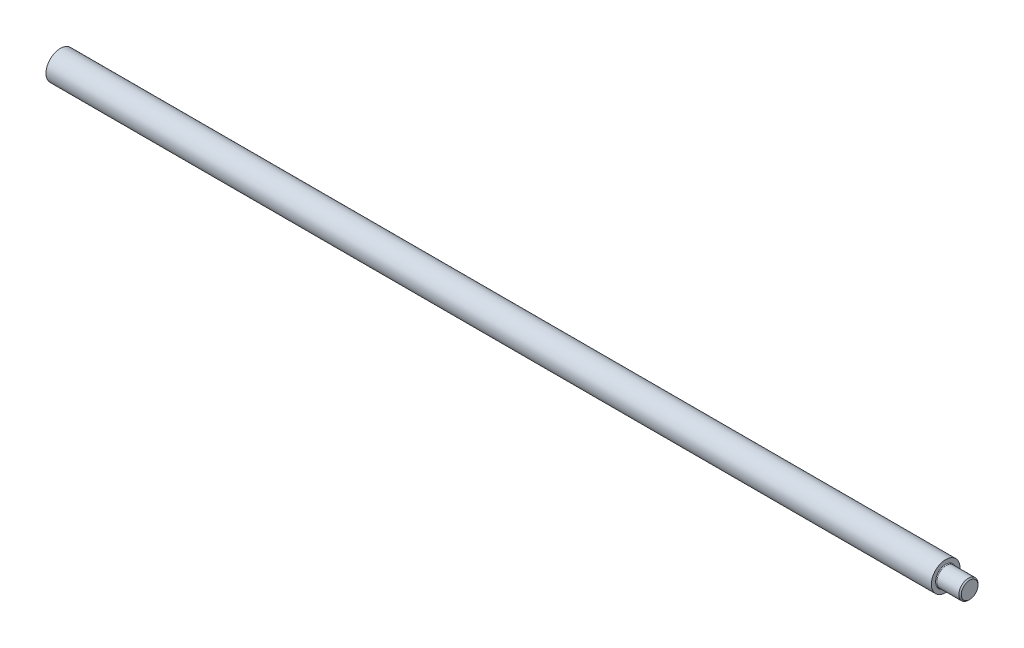
ISO-10303-21;
HEADER;
FILE_DESCRIPTION(('STEP AP214'),'2;1');
FILE_NAME('part.step','',(''),(''),'','','');
FILE_SCHEMA(('AUTOMOTIVE_DESIGN { 1 0 10303 214 1 1 1 1 }'));
ENDSEC;
DATA;
#1=APPLICATION_CONTEXT('core data for automotive mechanical design processes');
#2=APPLICATION_PROTOCOL_DEFINITION('international standard','automotive_design',2000,#1);
#3=PRODUCT_CONTEXT('',#1,'mechanical');
#4=PRODUCT('Part','Part','',(#3));
#5=PRODUCT_RELATED_PRODUCT_CATEGORY('part','',(#4));
#6=PRODUCT_DEFINITION_FORMATION('','',#4);
#7=PRODUCT_DEFINITION_CONTEXT('part definition',#1,'design');
#8=PRODUCT_DEFINITION('design','',#6,#7);
#9=PRODUCT_DEFINITION_SHAPE('','',#8);
#10=(LENGTH_UNIT() NAMED_UNIT(*) SI_UNIT(.MILLI.,.METRE.));
#11=(NAMED_UNIT(*) PLANE_ANGLE_UNIT() SI_UNIT($,.RADIAN.));
#12=(NAMED_UNIT(*) SI_UNIT($,.STERADIAN.) SOLID_ANGLE_UNIT());
#13=UNCERTAINTY_MEASURE_WITH_UNIT(LENGTH_MEASURE(1.E-05),#10,'distance_accuracy_value','');
#14=(GEOMETRIC_REPRESENTATION_CONTEXT(3) GLOBAL_UNCERTAINTY_ASSIGNED_CONTEXT((#13)) GLOBAL_UNIT_ASSIGNED_CONTEXT((#10,
#11,#12)) REPRESENTATION_CONTEXT('',''));
#15=CARTESIAN_POINT('',(0.,0.,0.));
#16=DIRECTION('',(0.,0.,1.));
#17=DIRECTION('',(1.,0.,0.));
#18=AXIS2_PLACEMENT_3D('',#15,#16,#17);
#19=CARTESIAN_POINT('',(0.,0.,0.));
#20=DIRECTION('',(1.,0.,0.));
#21=DIRECTION('',(0.,0.,-1.));
#22=AXIS2_PLACEMENT_3D('',#19,#20,#21);
#23=CYLINDRICAL_SURFACE('',#22,6.);
#24=CARTESIAN_POINT('',(0.,0.,0.));
#25=DIRECTION('',(1.,0.,0.));
#26=DIRECTION('',(0.,0.,-1.));
#27=AXIS2_PLACEMENT_3D('',#24,#25,#26);
#28=CIRCLE('',#27,6.);
#29=CARTESIAN_POINT('',(0.,0.,-6.));
#30=VERTEX_POINT('',#29);
#31=EDGE_CURVE('E53',#30,#30,#28,.T.);
#32=ORIENTED_EDGE('',*,*,#31,.T.);
#33=EDGE_LOOP('',(#32));
#34=FACE_BOUND('',#33,.T.);
#35=CARTESIAN_POINT('',(370.,0.,0.));
#36=DIRECTION('',(1.,0.,0.));
#37=DIRECTION('',(0.,0.,-1.));
#38=AXIS2_PLACEMENT_3D('',#35,#36,#37);
#39=CIRCLE('',#38,6.);
#40=CARTESIAN_POINT('',(370.,0.,-6.));
#41=VERTEX_POINT('',#40);
#42=EDGE_CURVE('E10',#41,#41,#39,.T.);
#43=ORIENTED_EDGE('',*,*,#42,.F.);
#44=EDGE_LOOP('',(#43));
#45=FACE_BOUND('',#44,.T.);
#46=ADVANCED_FACE('F31',(#34,#45),#23,.T.);
#47=CARTESIAN_POINT('',(370.,4.30000000000008,0.));
#48=DIRECTION('',(1.,0.,0.));
#49=DIRECTION('',(0.,0.,-1.));
#50=AXIS2_PLACEMENT_3D('',#47,#48,#49);
#51=PLANE('',#50);
#52=ORIENTED_EDGE('',*,*,#42,.T.);
#53=EDGE_LOOP('',(#52));
#54=FACE_BOUND('',#53,.T.);
#55=CARTESIAN_POINT('',(370.,0.,0.));
#56=DIRECTION('',(1.,0.,0.));
#57=DIRECTION('',(0.,0.,-1.));
#58=AXIS2_PLACEMENT_3D('',#55,#56,#57);
#59=CIRCLE('',#58,4.30000000000008);
#60=CARTESIAN_POINT('',(370.,0.,-4.30000000000008));
#61=VERTEX_POINT('',#60);
#62=EDGE_CURVE('E37',#61,#61,#59,.T.);
#63=ORIENTED_EDGE('',*,*,#62,.F.);
#64=EDGE_LOOP('',(#63));
#65=FACE_BOUND('',#64,.T.);
#66=ADVANCED_FACE('F70',(#54,#65),#51,.T.);
#67=CARTESIAN_POINT('',(370.3,0.,0.));
#68=DIRECTION('',(1.,0.,0.));
#69=DIRECTION('',(0.,0.,-1.));
#70=AXIS2_PLACEMENT_3D('',#67,#68,#69);
#71=TOROIDAL_SURFACE('',#70,4.30000000000008,0.300000000000074);
#72=ORIENTED_EDGE('',*,*,#62,.T.);
#73=EDGE_LOOP('',(#72));
#74=FACE_BOUND('',#73,.T.);
#75=CARTESIAN_POINT('',(370.3,0.,0.));
#76=DIRECTION('',(1.,0.,0.));
#77=DIRECTION('',(0.,0.,-1.));
#78=AXIS2_PLACEMENT_3D('',#75,#76,#77);
#79=CIRCLE('',#78,4.00000000000001);
#80=CARTESIAN_POINT('',(370.3,0.,-4.00000000000001));
#81=VERTEX_POINT('',#80);
#82=EDGE_CURVE('E41',#81,#81,#79,.T.);
#83=ORIENTED_EDGE('',*,*,#82,.F.);
#84=EDGE_LOOP('',(#83));
#85=FACE_BOUND('',#84,.T.);
#86=ADVANCED_FACE('F74',(#74,#85),#71,.F.);
#87=CARTESIAN_POINT('',(0.,0.,0.));
#88=DIRECTION('',(1.,0.,0.));
#89=DIRECTION('',(0.,0.,-1.));
#90=AXIS2_PLACEMENT_3D('',#87,#88,#89);
#91=CYLINDRICAL_SURFACE('',#90,4.00000000000001);
#92=ORIENTED_EDGE('',*,*,#82,.T.);
#93=EDGE_LOOP('',(#92));
#94=FACE_BOUND('',#93,.T.);
#95=CARTESIAN_POINT('',(379.5,0.,0.));
#96=DIRECTION('',(1.,0.,0.));
#97=DIRECTION('',(0.,0.,-1.));
#98=AXIS2_PLACEMENT_3D('',#95,#96,#97);
#99=CIRCLE('',#98,4.00000000000001);
#100=CARTESIAN_POINT('',(379.5,0.,-4.00000000000001));
#101=VERTEX_POINT('',#100);
#102=EDGE_CURVE('E45',#101,#101,#99,.T.);
#103=ORIENTED_EDGE('',*,*,#102,.F.);
#104=EDGE_LOOP('',(#103));
#105=FACE_BOUND('',#104,.T.);
#106=ADVANCED_FACE('F78',(#94,#105),#91,.T.);
#107=CARTESIAN_POINT('',(380.,0.,0.));
#108=DIRECTION('',(-1.,0.,0.));
#109=DIRECTION('',(0.,0.,1.));
#110=AXIS2_PLACEMENT_3D('',#107,#108,#109);
#111=CONICAL_SURFACE('',#110,3.50000000000001,0.785398163397443);
#112=ORIENTED_EDGE('',*,*,#102,.T.);
#113=EDGE_LOOP('',(#112));
#114=FACE_BOUND('',#113,.T.);
#115=CARTESIAN_POINT('',(380.,0.,0.));
#116=DIRECTION('',(1.,0.,0.));
#117=DIRECTION('',(0.,0.,-1.));
#118=AXIS2_PLACEMENT_3D('',#115,#116,#117);
#119=CIRCLE('',#118,3.50000000000001);
#120=CARTESIAN_POINT('',(380.,0.,-3.50000000000001));
#121=VERTEX_POINT('',#120);
#122=EDGE_CURVE('E50',#121,#121,#119,.T.);
#123=ORIENTED_EDGE('',*,*,#122,.F.);
#124=EDGE_LOOP('',(#123));
#125=FACE_BOUND('',#124,.T.);
#126=ADVANCED_FACE('F66',(#114,#125),#111,.T.);
#127=CARTESIAN_POINT('',(380.,0.,0.));
#128=DIRECTION('',(1.,0.,0.));
#129=DIRECTION('',(0.,0.,-1.));
#130=AXIS2_PLACEMENT_3D('',#127,#128,#129);
#131=PLANE('',#130);
#132=ORIENTED_EDGE('',*,*,#122,.T.);
#133=EDGE_LOOP('',(#132));
#134=FACE_BOUND('',#133,.T.);
#135=ADVANCED_FACE('F61',(#134),#131,.T.);
#136=CARTESIAN_POINT('',(0.,6.,0.));
#137=DIRECTION('',(-1.,0.,0.));
#138=DIRECTION('',(0.,0.,1.));
#139=AXIS2_PLACEMENT_3D('',#136,#137,#138);
#140=PLANE('',#139);
#141=ORIENTED_EDGE('',*,*,#31,.F.);
#142=EDGE_LOOP('',(#141));
#143=FACE_BOUND('',#142,.T.);
#144=ADVANCED_FACE('F59',(#143),#140,.T.);
#145=CLOSED_SHELL('',(#46,#66,#86,#106,#126,#135,#144));
#146=MANIFOLD_SOLID_BREP('B2',#145);
#147=ADVANCED_BREP_SHAPE_REPRESENTATION('',(#18,#146),#14);
#148=SHAPE_DEFINITION_REPRESENTATION(#9,#147);
ENDSEC;
END-ISO-10303-21;
